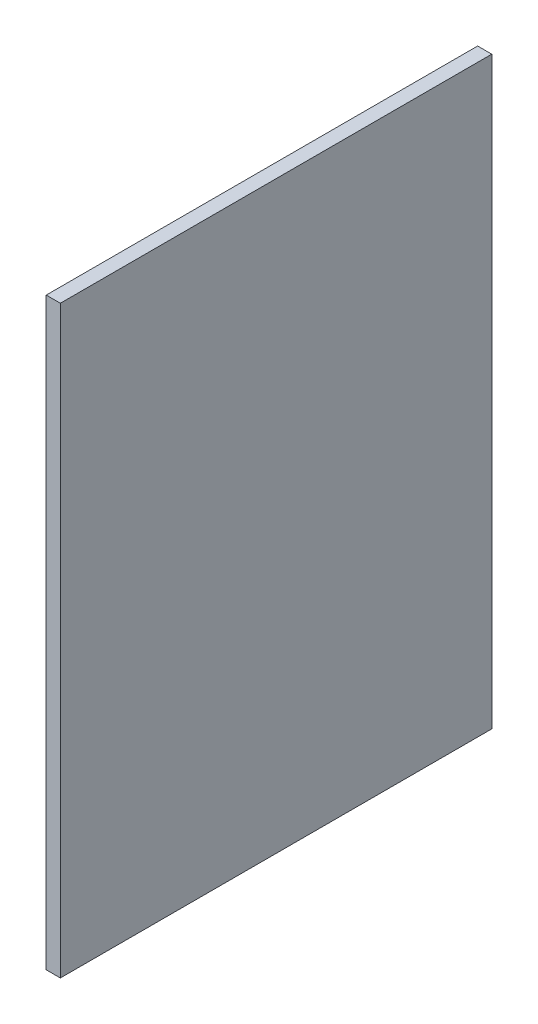
ISO-10303-21;
HEADER;
FILE_DESCRIPTION(('STEP AP214'),'2;1');
FILE_NAME('part.step','',(''),(''),'','','');
FILE_SCHEMA(('AUTOMOTIVE_DESIGN { 1 0 10303 214 1 1 1 1 }'));
ENDSEC;
DATA;
#1=APPLICATION_CONTEXT('core data for automotive mechanical design processes');
#2=APPLICATION_PROTOCOL_DEFINITION('international standard','automotive_design',2000,#1);
#3=PRODUCT_CONTEXT('',#1,'mechanical');
#4=PRODUCT('Part','Part','',(#3));
#5=PRODUCT_RELATED_PRODUCT_CATEGORY('part','',(#4));
#6=PRODUCT_DEFINITION_FORMATION('','',#4);
#7=PRODUCT_DEFINITION_CONTEXT('part definition',#1,'design');
#8=PRODUCT_DEFINITION('design','',#6,#7);
#9=PRODUCT_DEFINITION_SHAPE('','',#8);
#10=(LENGTH_UNIT() NAMED_UNIT(*) SI_UNIT(.MILLI.,.METRE.));
#11=(NAMED_UNIT(*) PLANE_ANGLE_UNIT() SI_UNIT($,.RADIAN.));
#12=(NAMED_UNIT(*) SI_UNIT($,.STERADIAN.) SOLID_ANGLE_UNIT());
#13=UNCERTAINTY_MEASURE_WITH_UNIT(LENGTH_MEASURE(1.E-05),#10,'distance_accuracy_value','');
#14=(GEOMETRIC_REPRESENTATION_CONTEXT(3) GLOBAL_UNCERTAINTY_ASSIGNED_CONTEXT((#13)) GLOBAL_UNIT_ASSIGNED_CONTEXT((#10,
#11,#12)) REPRESENTATION_CONTEXT('',''));
#15=CARTESIAN_POINT('',(0.,0.,0.));
#16=DIRECTION('',(0.,0.,1.));
#17=DIRECTION('',(1.,0.,0.));
#18=AXIS2_PLACEMENT_3D('',#15,#16,#17);
#19=CARTESIAN_POINT('',(18.,-73.8554715174473,59.7758840206666));
#20=DIRECTION('',(0.,0.,-1.));
#21=DIRECTION('',(-1.,0.,0.));
#22=AXIS2_PLACEMENT_3D('',#19,#20,#21);
#23=PLANE('',#22);
#24=DIRECTION('',(0.,-1.,0.));
#25=VECTOR('',#24,1.);
#26=CARTESIAN_POINT('',(0.,-73.8554715174473,59.7758840206666));
#27=LINE('',#26,#25);
#28=CARTESIAN_POINT('',(0.,671.144528482553,59.7758840206666));
#29=VERTEX_POINT('',#28);
#30=CARTESIAN_POINT('',(0.,-73.8554715174473,59.7758840206666));
#31=VERTEX_POINT('',#30);
#32=EDGE_CURVE('E96',#29,#31,#27,.T.);
#33=ORIENTED_EDGE('',*,*,#32,.T.);
#34=DIRECTION('',(-1.,0.,0.));
#35=VECTOR('',#34,1.);
#36=CARTESIAN_POINT('',(18.,-73.8554715174473,59.7758840206666));
#37=LINE('',#36,#35);
#38=CARTESIAN_POINT('',(18.,-73.8554715174473,59.7758840206666));
#39=VERTEX_POINT('',#38);
#40=EDGE_CURVE('E11',#39,#31,#37,.T.);
#41=ORIENTED_EDGE('',*,*,#40,.F.);
#42=DIRECTION('',(0.,-1.,0.));
#43=VECTOR('',#42,1.);
#44=CARTESIAN_POINT('',(18.,-73.8554715174473,59.7758840206666));
#45=LINE('',#44,#43);
#46=CARTESIAN_POINT('',(18.,671.144528482553,59.7758840206666));
#47=VERTEX_POINT('',#46);
#48=EDGE_CURVE('E84',#47,#39,#45,.T.);
#49=ORIENTED_EDGE('',*,*,#48,.F.);
#50=DIRECTION('',(-1.,0.,0.));
#51=VECTOR('',#50,1.);
#52=CARTESIAN_POINT('',(18.,671.144528482553,59.7758840206666));
#53=LINE('',#52,#51);
#54=EDGE_CURVE('E92',#47,#29,#53,.T.);
#55=ORIENTED_EDGE('',*,*,#54,.T.);
#56=EDGE_LOOP('',(#33,#41,#49,#55));
#57=FACE_BOUND('',#56,.T.);
#58=ADVANCED_FACE('F33',(#57),#23,.F.);
#59=CARTESIAN_POINT('',(18.,-73.8554715174472,-490.224115979333));
#60=DIRECTION('',(0.,1.,0.));
#61=DIRECTION('',(0.,0.,1.));
#62=AXIS2_PLACEMENT_3D('',#59,#60,#61);
#63=PLANE('',#62);
#64=DIRECTION('',(0.,0.,-1.));
#65=VECTOR('',#64,1.);
#66=CARTESIAN_POINT('',(0.,-73.8554715174472,-490.224115979333));
#67=LINE('',#66,#65);
#68=CARTESIAN_POINT('',(0.,-73.8554715174472,-490.224115979333));
#69=VERTEX_POINT('',#68);
#70=EDGE_CURVE('E88',#31,#69,#67,.T.);
#71=ORIENTED_EDGE('',*,*,#70,.T.);
#72=DIRECTION('',(-1.,0.,0.));
#73=VECTOR('',#72,1.);
#74=CARTESIAN_POINT('',(18.,-73.8554715174472,-490.224115979333));
#75=LINE('',#74,#73);
#76=CARTESIAN_POINT('',(18.,-73.8554715174472,-490.224115979333));
#77=VERTEX_POINT('',#76);
#78=EDGE_CURVE('E41',#77,#69,#75,.T.);
#79=ORIENTED_EDGE('',*,*,#78,.F.);
#80=DIRECTION('',(0.,0.,-1.));
#81=VECTOR('',#80,1.);
#82=CARTESIAN_POINT('',(18.,-73.8554715174472,-490.224115979333));
#83=LINE('',#82,#81);
#84=EDGE_CURVE('E79',#39,#77,#83,.T.);
#85=ORIENTED_EDGE('',*,*,#84,.F.);
#86=ORIENTED_EDGE('',*,*,#40,.T.);
#87=EDGE_LOOP('',(#71,#79,#85,#86));
#88=FACE_BOUND('',#87,.T.);
#89=ADVANCED_FACE('F87',(#88),#63,.F.);
#90=CARTESIAN_POINT('',(18.,-73.8554715174472,-490.224115979333));
#91=DIRECTION('',(0.,0.,1.));
#92=DIRECTION('',(1.,0.,0.));
#93=AXIS2_PLACEMENT_3D('',#90,#91,#92);
#94=PLANE('',#93);
#95=DIRECTION('',(0.,1.,0.));
#96=VECTOR('',#95,1.);
#97=CARTESIAN_POINT('',(0.,-73.8554715174472,-490.224115979333));
#98=LINE('',#97,#96);
#99=CARTESIAN_POINT('',(0.,671.144528482553,-490.224115979333));
#100=VERTEX_POINT('',#99);
#101=EDGE_CURVE('E66',#69,#100,#98,.T.);
#102=ORIENTED_EDGE('',*,*,#101,.T.);
#103=DIRECTION('',(-1.,0.,0.));
#104=VECTOR('',#103,1.);
#105=CARTESIAN_POINT('',(18.,671.144528482553,-490.224115979333));
#106=LINE('',#105,#104);
#107=CARTESIAN_POINT('',(18.,671.144528482553,-490.224115979333));
#108=VERTEX_POINT('',#107);
#109=EDGE_CURVE('E89',#108,#100,#106,.T.);
#110=ORIENTED_EDGE('',*,*,#109,.F.);
#111=DIRECTION('',(0.,1.,0.));
#112=VECTOR('',#111,1.);
#113=CARTESIAN_POINT('',(18.,-73.8554715174472,-490.224115979333));
#114=LINE('',#113,#112);
#115=EDGE_CURVE('E82',#77,#108,#114,.T.);
#116=ORIENTED_EDGE('',*,*,#115,.F.);
#117=ORIENTED_EDGE('',*,*,#78,.T.);
#118=EDGE_LOOP('',(#102,#110,#116,#117));
#119=FACE_BOUND('',#118,.T.);
#120=ADVANCED_FACE('F90',(#119),#94,.F.);
#121=CARTESIAN_POINT('',(18.,671.144528482553,-490.224115979333));
#122=DIRECTION('',(0.,-1.,0.));
#123=DIRECTION('',(0.,0.,-1.));
#124=AXIS2_PLACEMENT_3D('',#121,#122,#123);
#125=PLANE('',#124);
#126=DIRECTION('',(0.,0.,1.));
#127=VECTOR('',#126,1.);
#128=CARTESIAN_POINT('',(0.,671.144528482553,-490.224115979333));
#129=LINE('',#128,#127);
#130=EDGE_CURVE('E72',#100,#29,#129,.T.);
#131=ORIENTED_EDGE('',*,*,#130,.T.);
#132=ORIENTED_EDGE('',*,*,#54,.F.);
#133=DIRECTION('',(0.,0.,1.));
#134=VECTOR('',#133,1.);
#135=CARTESIAN_POINT('',(18.,671.144528482553,-490.224115979333));
#136=LINE('',#135,#134);
#137=EDGE_CURVE('E49',#108,#47,#136,.T.);
#138=ORIENTED_EDGE('',*,*,#137,.F.);
#139=ORIENTED_EDGE('',*,*,#109,.T.);
#140=EDGE_LOOP('',(#131,#132,#138,#139));
#141=FACE_BOUND('',#140,.T.);
#142=ADVANCED_FACE('F103',(#141),#125,.F.);
#143=CARTESIAN_POINT('',(18.,0.,0.));
#144=DIRECTION('',(1.,0.,0.));
#145=DIRECTION('',(0.,0.,-1.));
#146=AXIS2_PLACEMENT_3D('',#143,#144,#145);
#147=PLANE('',#146);
#148=ORIENTED_EDGE('',*,*,#48,.T.);
#149=ORIENTED_EDGE('',*,*,#84,.T.);
#150=ORIENTED_EDGE('',*,*,#115,.T.);
#151=ORIENTED_EDGE('',*,*,#137,.T.);
#152=EDGE_LOOP('',(#148,#149,#150,#151));
#153=FACE_BOUND('',#152,.T.);
#154=ADVANCED_FACE('F80',(#153),#147,.T.);
#155=CARTESIAN_POINT('',(0.,0.,0.));
#156=DIRECTION('',(1.,0.,0.));
#157=DIRECTION('',(0.,0.,-1.));
#158=AXIS2_PLACEMENT_3D('',#155,#156,#157);
#159=PLANE('',#158);
#160=ORIENTED_EDGE('',*,*,#32,.F.);
#161=ORIENTED_EDGE('',*,*,#130,.F.);
#162=ORIENTED_EDGE('',*,*,#101,.F.);
#163=ORIENTED_EDGE('',*,*,#70,.F.);
#164=EDGE_LOOP('',(#160,#161,#162,#163));
#165=FACE_BOUND('',#164,.T.);
#166=ADVANCED_FACE('F106',(#165),#159,.F.);
#167=CLOSED_SHELL('',(#58,#89,#120,#142,#154,#166));
#168=MANIFOLD_SOLID_BREP('B2',#167);
#169=ADVANCED_BREP_SHAPE_REPRESENTATION('',(#18,#168),#14);
#170=SHAPE_DEFINITION_REPRESENTATION(#9,#169);
ENDSEC;
END-ISO-10303-21;
